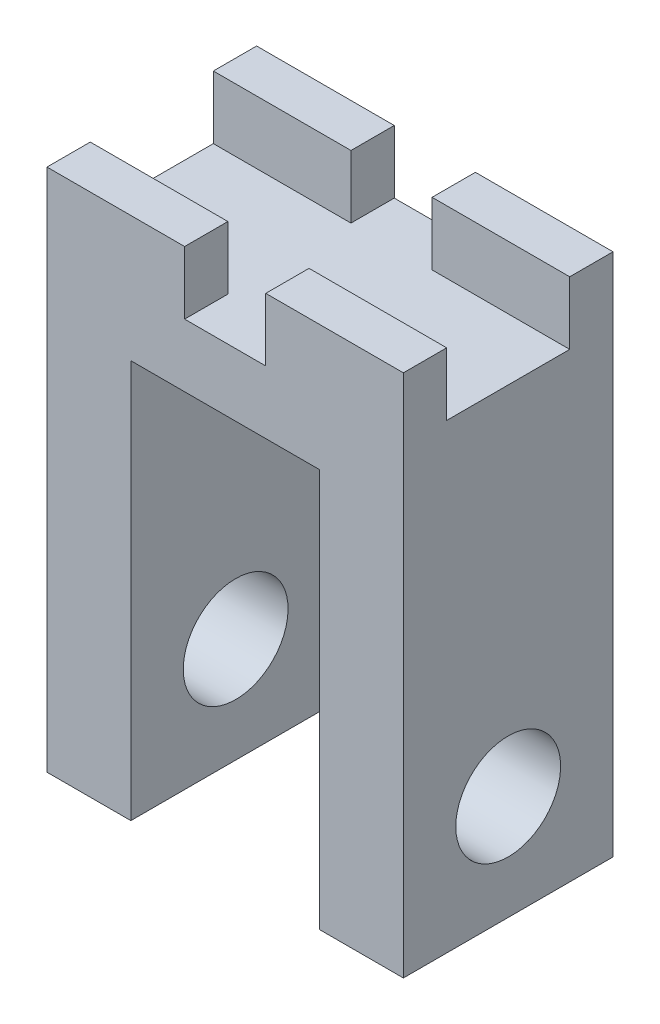
ISO-10303-21;
HEADER;
FILE_DESCRIPTION(('STEP AP214'),'2;1');
FILE_NAME('part.step','',(''),(''),'','','');
FILE_SCHEMA(('AUTOMOTIVE_DESIGN { 1 0 10303 214 1 1 1 1 }'));
ENDSEC;
DATA;
#1=APPLICATION_CONTEXT('core data for automotive mechanical design processes');
#2=APPLICATION_PROTOCOL_DEFINITION('international standard','automotive_design',2000,#1);
#3=PRODUCT_CONTEXT('',#1,'mechanical');
#4=PRODUCT('Part','Part','',(#3));
#5=PRODUCT_RELATED_PRODUCT_CATEGORY('part','',(#4));
#6=PRODUCT_DEFINITION_FORMATION('','',#4);
#7=PRODUCT_DEFINITION_CONTEXT('part definition',#1,'design');
#8=PRODUCT_DEFINITION('design','',#6,#7);
#9=PRODUCT_DEFINITION_SHAPE('','',#8);
#10=(LENGTH_UNIT() NAMED_UNIT(*) SI_UNIT(.MILLI.,.METRE.));
#11=(NAMED_UNIT(*) PLANE_ANGLE_UNIT() SI_UNIT($,.RADIAN.));
#12=(NAMED_UNIT(*) SI_UNIT($,.STERADIAN.) SOLID_ANGLE_UNIT());
#13=UNCERTAINTY_MEASURE_WITH_UNIT(LENGTH_MEASURE(1.E-05),#10,'distance_accuracy_value','');
#14=(GEOMETRIC_REPRESENTATION_CONTEXT(3) GLOBAL_UNCERTAINTY_ASSIGNED_CONTEXT((#13)) GLOBAL_UNIT_ASSIGNED_CONTEXT((#10,
#11,#12)) REPRESENTATION_CONTEXT('',''));
#15=CARTESIAN_POINT('',(0.,0.,0.));
#16=DIRECTION('',(0.,0.,1.));
#17=DIRECTION('',(1.,0.,0.));
#18=AXIS2_PLACEMENT_3D('',#15,#16,#17);
#19=CARTESIAN_POINT('',(0.,12.5,10.));
#20=DIRECTION('',(0.,1.,0.));
#21=DIRECTION('',(0.,0.,1.));
#22=AXIS2_PLACEMENT_3D('',#19,#20,#21);
#23=PLANE('',#22);
#24=DIRECTION('',(0.,0.,-1.));
#25=VECTOR('',#24,1.);
#26=CARTESIAN_POINT('',(1.935,12.5,10.));
#27=LINE('',#26,#25);
#28=CARTESIAN_POINT('',(1.935,12.5,10.));
#29=VERTEX_POINT('',#28);
#30=CARTESIAN_POINT('',(1.935,12.5,7.935));
#31=VERTEX_POINT('',#30);
#32=EDGE_CURVE('E54',#29,#31,#27,.T.);
#33=ORIENTED_EDGE('',*,*,#32,.T.);
#34=DIRECTION('',(-1.,0.,0.));
#35=VECTOR('',#34,1.);
#36=CARTESIAN_POINT('',(8.5,12.5,7.935));
#37=LINE('',#36,#35);
#38=CARTESIAN_POINT('',(8.5,12.5,7.935));
#39=VERTEX_POINT('',#38);
#40=EDGE_CURVE('E58',#39,#31,#37,.T.);
#41=ORIENTED_EDGE('',*,*,#40,.F.);
#42=DIRECTION('',(0.,0.,-1.));
#43=VECTOR('',#42,1.);
#44=CARTESIAN_POINT('',(8.5,12.5,10.));
#45=LINE('',#44,#43);
#46=CARTESIAN_POINT('',(8.5,12.5,2.065));
#47=VERTEX_POINT('',#46);
#48=EDGE_CURVE('E11',#39,#47,#45,.T.);
#49=ORIENTED_EDGE('',*,*,#48,.T.);
#50=DIRECTION('',(-1.,0.,0.));
#51=VECTOR('',#50,1.);
#52=CARTESIAN_POINT('',(8.5,12.5,2.065));
#53=LINE('',#52,#51);
#54=CARTESIAN_POINT('',(1.935,12.5,2.065));
#55=VERTEX_POINT('',#54);
#56=EDGE_CURVE('E241',#47,#55,#53,.T.);
#57=ORIENTED_EDGE('',*,*,#56,.T.);
#58=DIRECTION('',(0.,0.,1.));
#59=VECTOR('',#58,1.);
#60=CARTESIAN_POINT('',(1.935,12.5,0.));
#61=LINE('',#60,#59);
#62=CARTESIAN_POINT('',(1.935,12.5,0.));
#63=VERTEX_POINT('',#62);
#64=EDGE_CURVE('E254',#63,#55,#61,.T.);
#65=ORIENTED_EDGE('',*,*,#64,.F.);
#66=DIRECTION('',(1.,0.,0.));
#67=VECTOR('',#66,1.);
#68=CARTESIAN_POINT('',(0.,12.5,0.));
#69=LINE('',#68,#67);
#70=CARTESIAN_POINT('',(-1.935,12.5,0.));
#71=VERTEX_POINT('',#70);
#72=EDGE_CURVE('E301',#71,#63,#69,.T.);
#73=ORIENTED_EDGE('',*,*,#72,.F.);
#74=DIRECTION('',(0.,0.,1.));
#75=VECTOR('',#74,1.);
#76=CARTESIAN_POINT('',(-1.935,12.5,0.));
#77=LINE('',#76,#75);
#78=CARTESIAN_POINT('',(-1.935,12.5,2.065));
#79=VERTEX_POINT('',#78);
#80=EDGE_CURVE('E234',#71,#79,#77,.T.);
#81=ORIENTED_EDGE('',*,*,#80,.T.);
#82=DIRECTION('',(1.,0.,0.));
#83=VECTOR('',#82,1.);
#84=CARTESIAN_POINT('',(-8.5,12.5,2.065));
#85=LINE('',#84,#83);
#86=CARTESIAN_POINT('',(-8.5,12.5,2.065));
#87=VERTEX_POINT('',#86);
#88=EDGE_CURVE('E237',#87,#79,#85,.T.);
#89=ORIENTED_EDGE('',*,*,#88,.F.);
#90=DIRECTION('',(0.,0.,-1.));
#91=VECTOR('',#90,1.);
#92=CARTESIAN_POINT('',(-8.5,12.5,10.));
#93=LINE('',#92,#91);
#94=CARTESIAN_POINT('',(-8.5,12.5,7.935));
#95=VERTEX_POINT('',#94);
#96=EDGE_CURVE('E47',#95,#87,#93,.T.);
#97=ORIENTED_EDGE('',*,*,#96,.F.);
#98=DIRECTION('',(1.,0.,0.));
#99=VECTOR('',#98,1.);
#100=CARTESIAN_POINT('',(-8.5,12.5,7.935));
#101=LINE('',#100,#99);
#102=CARTESIAN_POINT('',(-1.935,12.5,7.935));
#103=VERTEX_POINT('',#102);
#104=EDGE_CURVE('E214',#95,#103,#101,.T.);
#105=ORIENTED_EDGE('',*,*,#104,.T.);
#106=DIRECTION('',(0.,0.,-1.));
#107=VECTOR('',#106,1.);
#108=CARTESIAN_POINT('',(-1.935,12.5,10.));
#109=LINE('',#108,#107);
#110=CARTESIAN_POINT('',(-1.935,12.5,10.));
#111=VERTEX_POINT('',#110);
#112=EDGE_CURVE('E211',#111,#103,#109,.T.);
#113=ORIENTED_EDGE('',*,*,#112,.F.);
#114=DIRECTION('',(1.,0.,0.));
#115=VECTOR('',#114,1.);
#116=CARTESIAN_POINT('',(0.,12.5,10.));
#117=LINE('',#116,#115);
#118=EDGE_CURVE('E284',#111,#29,#117,.T.);
#119=ORIENTED_EDGE('',*,*,#118,.T.);
#120=EDGE_LOOP('',(#33,#41,#49,#57,#65,#73,#81,#89,#97,#105,#113,#119));
#121=FACE_BOUND('',#120,.T.);
#122=ADVANCED_FACE('F38',(#121),#23,.T.);
#123=CARTESIAN_POINT('',(8.5,0.,10.));
#124=DIRECTION('',(1.,0.,0.));
#125=DIRECTION('',(0.,1.,0.));
#126=AXIS2_PLACEMENT_3D('',#123,#124,#125);
#127=PLANE('',#126);
#128=CARTESIAN_POINT('',(8.5,-4.5,5.));
#129=DIRECTION('',(-1.,0.,0.));
#130=DIRECTION('',(0.,0.,1.));
#131=AXIS2_PLACEMENT_3D('',#128,#129,#130);
#132=CIRCLE('',#131,2.5);
#133=CARTESIAN_POINT('',(8.5,-4.5,7.5));
#134=VERTEX_POINT('',#133);
#135=EDGE_CURVE('E267',#134,#134,#132,.T.);
#136=ORIENTED_EDGE('',*,*,#135,.T.);
#137=EDGE_LOOP('',(#136));
#138=FACE_BOUND('',#137,.T.);
#139=DIRECTION('',(0.,-1.,0.));
#140=VECTOR('',#139,1.);
#141=CARTESIAN_POINT('',(8.5,0.,0.));
#142=LINE('',#141,#140);
#143=CARTESIAN_POINT('',(8.5,15.5,0.));
#144=VERTEX_POINT('',#143);
#145=CARTESIAN_POINT('',(8.5,-9.5,0.));
#146=VERTEX_POINT('',#145);
#147=EDGE_CURVE('E281',#144,#146,#142,.T.);
#148=ORIENTED_EDGE('',*,*,#147,.F.);
#149=DIRECTION('',(0.,0.,1.));
#150=VECTOR('',#149,1.);
#151=CARTESIAN_POINT('',(8.5,15.5,0.));
#152=LINE('',#151,#150);
#153=CARTESIAN_POINT('',(8.5,15.5,2.065));
#154=VERTEX_POINT('',#153);
#155=EDGE_CURVE('E258',#144,#154,#152,.T.);
#156=ORIENTED_EDGE('',*,*,#155,.T.);
#157=DIRECTION('',(0.,-1.,0.));
#158=VECTOR('',#157,1.);
#159=CARTESIAN_POINT('',(8.5,15.5,2.065));
#160=LINE('',#159,#158);
#161=EDGE_CURVE('E265',#154,#47,#160,.T.);
#162=ORIENTED_EDGE('',*,*,#161,.T.);
#163=ORIENTED_EDGE('',*,*,#48,.F.);
#164=DIRECTION('',(0.,-1.,0.));
#165=VECTOR('',#164,1.);
#166=CARTESIAN_POINT('',(8.5,15.5,7.935));
#167=LINE('',#166,#165);
#168=CARTESIAN_POINT('',(8.5,15.5,7.935));
#169=VERTEX_POINT('',#168);
#170=EDGE_CURVE('E185',#169,#39,#167,.T.);
#171=ORIENTED_EDGE('',*,*,#170,.F.);
#172=DIRECTION('',(0.,0.,-1.));
#173=VECTOR('',#172,1.);
#174=CARTESIAN_POINT('',(8.5,15.5,10.));
#175=LINE('',#174,#173);
#176=CARTESIAN_POINT('',(8.5,15.5,10.));
#177=VERTEX_POINT('',#176);
#178=EDGE_CURVE('E174',#177,#169,#175,.T.);
#179=ORIENTED_EDGE('',*,*,#178,.F.);
#180=DIRECTION('',(0.,-1.,0.));
#181=VECTOR('',#180,1.);
#182=CARTESIAN_POINT('',(8.5,0.,10.));
#183=LINE('',#182,#181);
#184=CARTESIAN_POINT('',(8.5,-9.5,10.));
#185=VERTEX_POINT('',#184);
#186=EDGE_CURVE('E282',#177,#185,#183,.T.);
#187=ORIENTED_EDGE('',*,*,#186,.T.);
#188=DIRECTION('',(0.,0.,-1.));
#189=VECTOR('',#188,1.);
#190=CARTESIAN_POINT('',(8.5,-9.5,10.));
#191=LINE('',#190,#189);
#192=EDGE_CURVE('E315',#185,#146,#191,.T.);
#193=ORIENTED_EDGE('',*,*,#192,.T.);
#194=EDGE_LOOP('',(#148,#156,#162,#163,#171,#179,#187,#193));
#195=FACE_BOUND('',#194,.T.);
#196=ADVANCED_FACE('F40',(#138,#195),#127,.T.);
#197=CARTESIAN_POINT('',(-8.5,0.,10.));
#198=DIRECTION('',(1.,0.,0.));
#199=DIRECTION('',(0.,1.,0.));
#200=AXIS2_PLACEMENT_3D('',#197,#198,#199);
#201=PLANE('',#200);
#202=CARTESIAN_POINT('',(-8.5,-4.5,5.));
#203=DIRECTION('',(1.,0.,0.));
#204=DIRECTION('',(0.,1.,0.));
#205=AXIS2_PLACEMENT_3D('',#202,#203,#204);
#206=CIRCLE('',#205,2.5);
#207=CARTESIAN_POINT('',(-8.5,-2.,5.));
#208=VERTEX_POINT('',#207);
#209=EDGE_CURVE('E278',#208,#208,#206,.T.);
#210=ORIENTED_EDGE('',*,*,#209,.T.);
#211=EDGE_LOOP('',(#210));
#212=FACE_BOUND('',#211,.T.);
#213=DIRECTION('',(0.,-1.,0.));
#214=VECTOR('',#213,1.);
#215=CARTESIAN_POINT('',(-8.5,0.,0.));
#216=LINE('',#215,#214);
#217=CARTESIAN_POINT('',(-8.5,15.5,0.));
#218=VERTEX_POINT('',#217);
#219=CARTESIAN_POINT('',(-8.5,-9.5,0.));
#220=VERTEX_POINT('',#219);
#221=EDGE_CURVE('E303',#218,#220,#216,.T.);
#222=ORIENTED_EDGE('',*,*,#221,.T.);
#223=DIRECTION('',(0.,0.,-1.));
#224=VECTOR('',#223,1.);
#225=CARTESIAN_POINT('',(-8.5,-9.5,10.));
#226=LINE('',#225,#224);
#227=CARTESIAN_POINT('',(-8.5,-9.5,10.));
#228=VERTEX_POINT('',#227);
#229=EDGE_CURVE('E327',#228,#220,#226,.T.);
#230=ORIENTED_EDGE('',*,*,#229,.F.);
#231=DIRECTION('',(0.,-1.,0.));
#232=VECTOR('',#231,1.);
#233=CARTESIAN_POINT('',(-8.5,0.,10.));
#234=LINE('',#233,#232);
#235=CARTESIAN_POINT('',(-8.5,15.5,10.));
#236=VERTEX_POINT('',#235);
#237=EDGE_CURVE('E287',#236,#228,#234,.T.);
#238=ORIENTED_EDGE('',*,*,#237,.F.);
#239=DIRECTION('',(0.,0.,-1.));
#240=VECTOR('',#239,1.);
#241=CARTESIAN_POINT('',(-8.5,15.5,10.));
#242=LINE('',#241,#240);
#243=CARTESIAN_POINT('',(-8.5,15.5,7.935));
#244=VERTEX_POINT('',#243);
#245=EDGE_CURVE('E204',#236,#244,#242,.T.);
#246=ORIENTED_EDGE('',*,*,#245,.T.);
#247=DIRECTION('',(0.,-1.,0.));
#248=VECTOR('',#247,1.);
#249=CARTESIAN_POINT('',(-8.5,15.5,7.935));
#250=LINE('',#249,#248);
#251=EDGE_CURVE('E208',#244,#95,#250,.T.);
#252=ORIENTED_EDGE('',*,*,#251,.T.);
#253=ORIENTED_EDGE('',*,*,#96,.T.);
#254=DIRECTION('',(0.,-1.,0.));
#255=VECTOR('',#254,1.);
#256=CARTESIAN_POINT('',(-8.5,15.5,2.065));
#257=LINE('',#256,#255);
#258=CARTESIAN_POINT('',(-8.5,15.5,2.065));
#259=VERTEX_POINT('',#258);
#260=EDGE_CURVE('E230',#259,#87,#257,.T.);
#261=ORIENTED_EDGE('',*,*,#260,.F.);
#262=DIRECTION('',(0.,0.,1.));
#263=VECTOR('',#262,1.);
#264=CARTESIAN_POINT('',(-8.5,15.5,0.));
#265=LINE('',#264,#263);
#266=EDGE_CURVE('E233',#218,#259,#265,.T.);
#267=ORIENTED_EDGE('',*,*,#266,.F.);
#268=EDGE_LOOP('',(#222,#230,#238,#246,#252,#253,#261,#267));
#269=FACE_BOUND('',#268,.T.);
#270=ADVANCED_FACE('F332',(#212,#269),#201,.F.);
#271=CARTESIAN_POINT('',(0.,-9.5,10.));
#272=DIRECTION('',(0.,1.,0.));
#273=DIRECTION('',(0.,0.,1.));
#274=AXIS2_PLACEMENT_3D('',#271,#272,#273);
#275=PLANE('',#274);
#276=DIRECTION('',(1.,0.,0.));
#277=VECTOR('',#276,1.);
#278=CARTESIAN_POINT('',(0.,-9.5,0.));
#279=LINE('',#278,#277);
#280=CARTESIAN_POINT('',(-4.5,-9.5,0.));
#281=VERTEX_POINT('',#280);
#282=EDGE_CURVE('E305',#220,#281,#279,.T.);
#283=ORIENTED_EDGE('',*,*,#282,.T.);
#284=DIRECTION('',(0.,0.,-1.));
#285=VECTOR('',#284,1.);
#286=CARTESIAN_POINT('',(-4.5,-9.5,10.));
#287=LINE('',#286,#285);
#288=CARTESIAN_POINT('',(-4.5,-9.5,10.));
#289=VERTEX_POINT('',#288);
#290=EDGE_CURVE('E325',#289,#281,#287,.T.);
#291=ORIENTED_EDGE('',*,*,#290,.F.);
#292=DIRECTION('',(1.,0.,0.));
#293=VECTOR('',#292,1.);
#294=CARTESIAN_POINT('',(0.,-9.5,10.));
#295=LINE('',#294,#293);
#296=EDGE_CURVE('E289',#228,#289,#295,.T.);
#297=ORIENTED_EDGE('',*,*,#296,.F.);
#298=ORIENTED_EDGE('',*,*,#229,.T.);
#299=EDGE_LOOP('',(#283,#291,#297,#298));
#300=FACE_BOUND('',#299,.T.);
#301=ADVANCED_FACE('F355',(#300),#275,.F.);
#302=CARTESIAN_POINT('',(-4.5,0.,10.));
#303=DIRECTION('',(1.,0.,0.));
#304=DIRECTION('',(0.,1.,0.));
#305=AXIS2_PLACEMENT_3D('',#302,#303,#304);
#306=PLANE('',#305);
#307=CARTESIAN_POINT('',(-4.5,-4.5,5.));
#308=DIRECTION('',(1.,0.,0.));
#309=DIRECTION('',(0.,1.,0.));
#310=AXIS2_PLACEMENT_3D('',#307,#308,#309);
#311=CIRCLE('',#310,2.5);
#312=CARTESIAN_POINT('',(-4.5,-2.,5.));
#313=VERTEX_POINT('',#312);
#314=EDGE_CURVE('E275',#313,#313,#311,.T.);
#315=ORIENTED_EDGE('',*,*,#314,.F.);
#316=EDGE_LOOP('',(#315));
#317=FACE_BOUND('',#316,.T.);
#318=DIRECTION('',(0.,-1.,0.));
#319=VECTOR('',#318,1.);
#320=CARTESIAN_POINT('',(-4.5,0.,0.));
#321=LINE('',#320,#319);
#322=CARTESIAN_POINT('',(-4.5,9.5,0.));
#323=VERTEX_POINT('',#322);
#324=EDGE_CURVE('E308',#323,#281,#321,.T.);
#325=ORIENTED_EDGE('',*,*,#324,.F.);
#326=DIRECTION('',(0.,0.,-1.));
#327=VECTOR('',#326,1.);
#328=CARTESIAN_POINT('',(-4.5,9.5,10.));
#329=LINE('',#328,#327);
#330=CARTESIAN_POINT('',(-4.5,9.5,10.));
#331=VERTEX_POINT('',#330);
#332=EDGE_CURVE('E323',#331,#323,#329,.T.);
#333=ORIENTED_EDGE('',*,*,#332,.F.);
#334=DIRECTION('',(0.,-1.,0.));
#335=VECTOR('',#334,1.);
#336=CARTESIAN_POINT('',(-4.5,0.,10.));
#337=LINE('',#336,#335);
#338=EDGE_CURVE('E291',#331,#289,#337,.T.);
#339=ORIENTED_EDGE('',*,*,#338,.T.);
#340=ORIENTED_EDGE('',*,*,#290,.T.);
#341=EDGE_LOOP('',(#325,#333,#339,#340));
#342=FACE_BOUND('',#341,.T.);
#343=ADVANCED_FACE('F361',(#317,#342),#306,.T.);
#344=CARTESIAN_POINT('',(0.,9.5,10.));
#345=DIRECTION('',(0.,1.,0.));
#346=DIRECTION('',(0.,0.,1.));
#347=AXIS2_PLACEMENT_3D('',#344,#345,#346);
#348=PLANE('',#347);
#349=DIRECTION('',(1.,0.,0.));
#350=VECTOR('',#349,1.);
#351=CARTESIAN_POINT('',(0.,9.5,0.));
#352=LINE('',#351,#350);
#353=CARTESIAN_POINT('',(4.5,9.5,0.));
#354=VERTEX_POINT('',#353);
#355=EDGE_CURVE('E311',#323,#354,#352,.T.);
#356=ORIENTED_EDGE('',*,*,#355,.T.);
#357=DIRECTION('',(0.,0.,-1.));
#358=VECTOR('',#357,1.);
#359=CARTESIAN_POINT('',(4.5,9.5,10.));
#360=LINE('',#359,#358);
#361=CARTESIAN_POINT('',(4.5,9.5,10.));
#362=VERTEX_POINT('',#361);
#363=EDGE_CURVE('E320',#362,#354,#360,.T.);
#364=ORIENTED_EDGE('',*,*,#363,.F.);
#365=DIRECTION('',(1.,0.,0.));
#366=VECTOR('',#365,1.);
#367=CARTESIAN_POINT('',(0.,9.5,10.));
#368=LINE('',#367,#366);
#369=EDGE_CURVE('E295',#331,#362,#368,.T.);
#370=ORIENTED_EDGE('',*,*,#369,.F.);
#371=ORIENTED_EDGE('',*,*,#332,.T.);
#372=EDGE_LOOP('',(#356,#364,#370,#371));
#373=FACE_BOUND('',#372,.T.);
#374=ADVANCED_FACE('F405',(#373),#348,.F.);
#375=CARTESIAN_POINT('',(4.5,0.,10.));
#376=DIRECTION('',(1.,0.,0.));
#377=DIRECTION('',(0.,1.,0.));
#378=AXIS2_PLACEMENT_3D('',#375,#376,#377);
#379=PLANE('',#378);
#380=CARTESIAN_POINT('',(4.5,-4.5,5.));
#381=DIRECTION('',(1.,0.,0.));
#382=DIRECTION('',(0.,1.,0.));
#383=AXIS2_PLACEMENT_3D('',#380,#381,#382);
#384=CIRCLE('',#383,2.5);
#385=CARTESIAN_POINT('',(4.5,-2.,5.));
#386=VERTEX_POINT('',#385);
#387=EDGE_CURVE('E42',#386,#386,#384,.T.);
#388=ORIENTED_EDGE('',*,*,#387,.T.);
#389=EDGE_LOOP('',(#388));
#390=FACE_BOUND('',#389,.T.);
#391=DIRECTION('',(0.,-1.,0.));
#392=VECTOR('',#391,1.);
#393=CARTESIAN_POINT('',(4.5,0.,0.));
#394=LINE('',#393,#392);
#395=CARTESIAN_POINT('',(4.5,-9.5,0.));
#396=VERTEX_POINT('',#395);
#397=EDGE_CURVE('E313',#354,#396,#394,.T.);
#398=ORIENTED_EDGE('',*,*,#397,.T.);
#399=DIRECTION('',(0.,0.,-1.));
#400=VECTOR('',#399,1.);
#401=CARTESIAN_POINT('',(4.5,-9.5,10.));
#402=LINE('',#401,#400);
#403=CARTESIAN_POINT('',(4.5,-9.5,10.));
#404=VERTEX_POINT('',#403);
#405=EDGE_CURVE('E317',#404,#396,#402,.T.);
#406=ORIENTED_EDGE('',*,*,#405,.F.);
#407=DIRECTION('',(0.,-1.,0.));
#408=VECTOR('',#407,1.);
#409=CARTESIAN_POINT('',(4.5,0.,10.));
#410=LINE('',#409,#408);
#411=EDGE_CURVE('E297',#362,#404,#410,.T.);
#412=ORIENTED_EDGE('',*,*,#411,.F.);
#413=ORIENTED_EDGE('',*,*,#363,.T.);
#414=EDGE_LOOP('',(#398,#406,#412,#413));
#415=FACE_BOUND('',#414,.T.);
#416=ADVANCED_FACE('F409',(#390,#415),#379,.F.);
#417=EDGE_CURVE('E285',#396,#146,#279,.T.);
#418=ORIENTED_EDGE('',*,*,#417,.T.);
#419=ORIENTED_EDGE('',*,*,#192,.F.);
#420=EDGE_CURVE('E292',#404,#185,#295,.T.);
#421=ORIENTED_EDGE('',*,*,#420,.F.);
#422=ORIENTED_EDGE('',*,*,#405,.T.);
#423=EDGE_LOOP('',(#418,#419,#421,#422));
#424=FACE_BOUND('',#423,.T.);
#425=ADVANCED_FACE('F413',(#424),#275,.F.);
#426=CARTESIAN_POINT('',(0.,0.,10.));
#427=DIRECTION('',(0.,0.,1.));
#428=DIRECTION('',(1.,0.,0.));
#429=AXIS2_PLACEMENT_3D('',#426,#427,#428);
#430=PLANE('',#429);
#431=ORIENTED_EDGE('',*,*,#186,.F.);
#432=DIRECTION('',(-1.,0.,0.));
#433=VECTOR('',#432,1.);
#434=CARTESIAN_POINT('',(8.5,15.5,10.));
#435=LINE('',#434,#433);
#436=CARTESIAN_POINT('',(1.935,15.5,10.));
#437=VERTEX_POINT('',#436);
#438=EDGE_CURVE('E182',#177,#437,#435,.T.);
#439=ORIENTED_EDGE('',*,*,#438,.T.);
#440=DIRECTION('',(0.,-1.,0.));
#441=VECTOR('',#440,1.);
#442=CARTESIAN_POINT('',(1.935,15.5,10.));
#443=LINE('',#442,#441);
#444=EDGE_CURVE('E190',#437,#29,#443,.T.);
#445=ORIENTED_EDGE('',*,*,#444,.T.);
#446=ORIENTED_EDGE('',*,*,#118,.F.);
#447=DIRECTION('',(0.,-1.,0.));
#448=VECTOR('',#447,1.);
#449=CARTESIAN_POINT('',(-1.935,15.5,10.));
#450=LINE('',#449,#448);
#451=CARTESIAN_POINT('',(-1.935,15.5,10.));
#452=VERTEX_POINT('',#451);
#453=EDGE_CURVE('E205',#452,#111,#450,.T.);
#454=ORIENTED_EDGE('',*,*,#453,.F.);
#455=DIRECTION('',(1.,0.,0.));
#456=VECTOR('',#455,1.);
#457=CARTESIAN_POINT('',(-8.5,15.5,10.));
#458=LINE('',#457,#456);
#459=EDGE_CURVE('E220',#236,#452,#458,.T.);
#460=ORIENTED_EDGE('',*,*,#459,.F.);
#461=ORIENTED_EDGE('',*,*,#237,.T.);
#462=ORIENTED_EDGE('',*,*,#296,.T.);
#463=ORIENTED_EDGE('',*,*,#338,.F.);
#464=ORIENTED_EDGE('',*,*,#369,.T.);
#465=ORIENTED_EDGE('',*,*,#411,.T.);
#466=ORIENTED_EDGE('',*,*,#420,.T.);
#467=EDGE_LOOP('',(#431,#439,#445,#446,#454,#460,#461,#462,#463,#464,#465,#466));
#468=FACE_BOUND('',#467,.T.);
#469=ADVANCED_FACE('F365',(#468),#430,.T.);
#470=CARTESIAN_POINT('',(0.,0.,0.));
#471=DIRECTION('',(0.,0.,1.));
#472=DIRECTION('',(1.,0.,0.));
#473=AXIS2_PLACEMENT_3D('',#470,#471,#472);
#474=PLANE('',#473);
#475=ORIENTED_EDGE('',*,*,#147,.T.);
#476=ORIENTED_EDGE('',*,*,#417,.F.);
#477=ORIENTED_EDGE('',*,*,#397,.F.);
#478=ORIENTED_EDGE('',*,*,#355,.F.);
#479=ORIENTED_EDGE('',*,*,#324,.T.);
#480=ORIENTED_EDGE('',*,*,#282,.F.);
#481=ORIENTED_EDGE('',*,*,#221,.F.);
#482=DIRECTION('',(1.,0.,0.));
#483=VECTOR('',#482,1.);
#484=CARTESIAN_POINT('',(-8.5,15.5,0.));
#485=LINE('',#484,#483);
#486=CARTESIAN_POINT('',(-1.935,15.5,0.));
#487=VERTEX_POINT('',#486);
#488=EDGE_CURVE('E243',#218,#487,#485,.T.);
#489=ORIENTED_EDGE('',*,*,#488,.T.);
#490=DIRECTION('',(0.,-1.,0.));
#491=VECTOR('',#490,1.);
#492=CARTESIAN_POINT('',(-1.935,15.5,0.));
#493=LINE('',#492,#491);
#494=EDGE_CURVE('E227',#487,#71,#493,.T.);
#495=ORIENTED_EDGE('',*,*,#494,.T.);
#496=ORIENTED_EDGE('',*,*,#72,.T.);
#497=DIRECTION('',(0.,-1.,0.));
#498=VECTOR('',#497,1.);
#499=CARTESIAN_POINT('',(1.935,15.5,0.));
#500=LINE('',#499,#498);
#501=CARTESIAN_POINT('',(1.935,15.5,0.));
#502=VERTEX_POINT('',#501);
#503=EDGE_CURVE('E268',#502,#63,#500,.T.);
#504=ORIENTED_EDGE('',*,*,#503,.F.);
#505=DIRECTION('',(-1.,0.,0.));
#506=VECTOR('',#505,1.);
#507=CARTESIAN_POINT('',(8.5,15.5,0.));
#508=LINE('',#507,#506);
#509=EDGE_CURVE('E256',#144,#502,#508,.T.);
#510=ORIENTED_EDGE('',*,*,#509,.F.);
#511=EDGE_LOOP('',(#475,#476,#477,#478,#479,#480,#481,#489,#495,#496,#504,#510));
#512=FACE_BOUND('',#511,.T.);
#513=ADVANCED_FACE('F346',(#512),#474,.F.);
#514=CARTESIAN_POINT('',(8.5,-4.5,5.));
#515=DIRECTION('',(-1.,0.,0.));
#516=DIRECTION('',(0.,0.,1.));
#517=AXIS2_PLACEMENT_3D('',#514,#515,#516);
#518=CYLINDRICAL_SURFACE('',#517,2.5);
#519=ORIENTED_EDGE('',*,*,#135,.F.);
#520=EDGE_LOOP('',(#519));
#521=FACE_BOUND('',#520,.T.);
#522=ORIENTED_EDGE('',*,*,#387,.F.);
#523=EDGE_LOOP('',(#522));
#524=FACE_BOUND('',#523,.T.);
#525=ADVANCED_FACE('F420',(#521,#524),#518,.F.);
#526=ORIENTED_EDGE('',*,*,#314,.T.);
#527=EDGE_LOOP('',(#526));
#528=FACE_BOUND('',#527,.T.);
#529=ORIENTED_EDGE('',*,*,#209,.F.);
#530=EDGE_LOOP('',(#529));
#531=FACE_BOUND('',#530,.T.);
#532=ADVANCED_FACE('F423',(#528,#531),#518,.F.);
#533=CARTESIAN_POINT('',(8.5,15.5,2.065));
#534=DIRECTION('',(0.,0.,1.));
#535=DIRECTION('',(1.,0.,0.));
#536=AXIS2_PLACEMENT_3D('',#533,#534,#535);
#537=PLANE('',#536);
#538=ORIENTED_EDGE('',*,*,#56,.F.);
#539=ORIENTED_EDGE('',*,*,#161,.F.);
#540=DIRECTION('',(-1.,0.,0.));
#541=VECTOR('',#540,1.);
#542=CARTESIAN_POINT('',(8.5,15.5,2.065));
#543=LINE('',#542,#541);
#544=CARTESIAN_POINT('',(1.935,15.5,2.065));
#545=VERTEX_POINT('',#544);
#546=EDGE_CURVE('E250',#154,#545,#543,.T.);
#547=ORIENTED_EDGE('',*,*,#546,.T.);
#548=DIRECTION('',(0.,-1.,0.));
#549=VECTOR('',#548,1.);
#550=CARTESIAN_POINT('',(1.935,15.5,2.065));
#551=LINE('',#550,#549);
#552=EDGE_CURVE('E261',#545,#55,#551,.T.);
#553=ORIENTED_EDGE('',*,*,#552,.T.);
#554=EDGE_LOOP('',(#538,#539,#547,#553));
#555=FACE_BOUND('',#554,.T.);
#556=ADVANCED_FACE('F426',(#555),#537,.T.);
#557=CARTESIAN_POINT('',(1.935,15.5,0.));
#558=DIRECTION('',(1.,0.,0.));
#559=DIRECTION('',(0.,0.,-1.));
#560=AXIS2_PLACEMENT_3D('',#557,#558,#559);
#561=PLANE('',#560);
#562=ORIENTED_EDGE('',*,*,#64,.T.);
#563=ORIENTED_EDGE('',*,*,#552,.F.);
#564=DIRECTION('',(0.,0.,1.));
#565=VECTOR('',#564,1.);
#566=CARTESIAN_POINT('',(1.935,15.5,0.));
#567=LINE('',#566,#565);
#568=EDGE_CURVE('E253',#502,#545,#567,.T.);
#569=ORIENTED_EDGE('',*,*,#568,.F.);
#570=ORIENTED_EDGE('',*,*,#503,.T.);
#571=EDGE_LOOP('',(#562,#563,#569,#570));
#572=FACE_BOUND('',#571,.T.);
#573=ADVANCED_FACE('F430',(#572),#561,.F.);
#574=CARTESIAN_POINT('',(0.,15.5,0.));
#575=DIRECTION('',(0.,1.,0.));
#576=DIRECTION('',(0.,0.,1.));
#577=AXIS2_PLACEMENT_3D('',#574,#575,#576);
#578=PLANE('',#577);
#579=ORIENTED_EDGE('',*,*,#546,.F.);
#580=ORIENTED_EDGE('',*,*,#155,.F.);
#581=ORIENTED_EDGE('',*,*,#509,.T.);
#582=ORIENTED_EDGE('',*,*,#568,.T.);
#583=EDGE_LOOP('',(#579,#580,#581,#582));
#584=FACE_BOUND('',#583,.T.);
#585=ADVANCED_FACE('F434',(#584),#578,.T.);
#586=CARTESIAN_POINT('',(-8.5,15.5,2.065));
#587=DIRECTION('',(0.,0.,-1.));
#588=DIRECTION('',(-1.,0.,0.));
#589=AXIS2_PLACEMENT_3D('',#586,#587,#588);
#590=PLANE('',#589);
#591=ORIENTED_EDGE('',*,*,#88,.T.);
#592=DIRECTION('',(0.,-1.,0.));
#593=VECTOR('',#592,1.);
#594=CARTESIAN_POINT('',(-1.935,15.5,2.065));
#595=LINE('',#594,#593);
#596=CARTESIAN_POINT('',(-1.935,15.5,2.065));
#597=VERTEX_POINT('',#596);
#598=EDGE_CURVE('E217',#597,#79,#595,.T.);
#599=ORIENTED_EDGE('',*,*,#598,.F.);
#600=DIRECTION('',(1.,0.,0.));
#601=VECTOR('',#600,1.);
#602=CARTESIAN_POINT('',(-8.5,15.5,2.065));
#603=LINE('',#602,#601);
#604=EDGE_CURVE('E238',#259,#597,#603,.T.);
#605=ORIENTED_EDGE('',*,*,#604,.F.);
#606=ORIENTED_EDGE('',*,*,#260,.T.);
#607=EDGE_LOOP('',(#591,#599,#605,#606));
#608=FACE_BOUND('',#607,.T.);
#609=ADVANCED_FACE('F338',(#608),#590,.F.);
#610=CARTESIAN_POINT('',(-1.935,15.5,0.));
#611=DIRECTION('',(1.,0.,0.));
#612=DIRECTION('',(0.,0.,-1.));
#613=AXIS2_PLACEMENT_3D('',#610,#611,#612);
#614=PLANE('',#613);
#615=ORIENTED_EDGE('',*,*,#80,.F.);
#616=ORIENTED_EDGE('',*,*,#494,.F.);
#617=DIRECTION('',(0.,0.,1.));
#618=VECTOR('',#617,1.);
#619=CARTESIAN_POINT('',(-1.935,15.5,0.));
#620=LINE('',#619,#618);
#621=EDGE_CURVE('E246',#487,#597,#620,.T.);
#622=ORIENTED_EDGE('',*,*,#621,.T.);
#623=ORIENTED_EDGE('',*,*,#598,.T.);
#624=EDGE_LOOP('',(#615,#616,#622,#623));
#625=FACE_BOUND('',#624,.T.);
#626=ADVANCED_FACE('F343',(#625),#614,.T.);
#627=CARTESIAN_POINT('',(0.,15.5,0.));
#628=DIRECTION('',(0.,-1.,0.));
#629=DIRECTION('',(0.,0.,-1.));
#630=AXIS2_PLACEMENT_3D('',#627,#628,#629);
#631=PLANE('',#630);
#632=ORIENTED_EDGE('',*,*,#604,.T.);
#633=ORIENTED_EDGE('',*,*,#621,.F.);
#634=ORIENTED_EDGE('',*,*,#488,.F.);
#635=ORIENTED_EDGE('',*,*,#266,.T.);
#636=EDGE_LOOP('',(#632,#633,#634,#635));
#637=FACE_BOUND('',#636,.T.);
#638=ADVANCED_FACE('F351',(#637),#631,.F.);
#639=CARTESIAN_POINT('',(-8.5,15.5,7.935));
#640=DIRECTION('',(0.,0.,-1.));
#641=DIRECTION('',(-1.,0.,0.));
#642=AXIS2_PLACEMENT_3D('',#639,#640,#641);
#643=PLANE('',#642);
#644=ORIENTED_EDGE('',*,*,#104,.F.);
#645=ORIENTED_EDGE('',*,*,#251,.F.);
#646=DIRECTION('',(1.,0.,0.));
#647=VECTOR('',#646,1.);
#648=CARTESIAN_POINT('',(-8.5,15.5,7.935));
#649=LINE('',#648,#647);
#650=CARTESIAN_POINT('',(-1.935,15.5,7.935));
#651=VERTEX_POINT('',#650);
#652=EDGE_CURVE('E215',#244,#651,#649,.T.);
#653=ORIENTED_EDGE('',*,*,#652,.T.);
#654=DIRECTION('',(0.,-1.,0.));
#655=VECTOR('',#654,1.);
#656=CARTESIAN_POINT('',(-1.935,15.5,7.935));
#657=LINE('',#656,#655);
#658=EDGE_CURVE('E201',#651,#103,#657,.T.);
#659=ORIENTED_EDGE('',*,*,#658,.T.);
#660=EDGE_LOOP('',(#644,#645,#653,#659));
#661=FACE_BOUND('',#660,.T.);
#662=ADVANCED_FACE('F376',(#661),#643,.T.);
#663=CARTESIAN_POINT('',(-1.935,15.5,10.));
#664=DIRECTION('',(-1.,0.,0.));
#665=DIRECTION('',(0.,0.,1.));
#666=AXIS2_PLACEMENT_3D('',#663,#664,#665);
#667=PLANE('',#666);
#668=ORIENTED_EDGE('',*,*,#112,.T.);
#669=ORIENTED_EDGE('',*,*,#658,.F.);
#670=DIRECTION('',(0.,0.,-1.));
#671=VECTOR('',#670,1.);
#672=CARTESIAN_POINT('',(-1.935,15.5,10.));
#673=LINE('',#672,#671);
#674=EDGE_CURVE('E222',#452,#651,#673,.T.);
#675=ORIENTED_EDGE('',*,*,#674,.F.);
#676=ORIENTED_EDGE('',*,*,#453,.T.);
#677=EDGE_LOOP('',(#668,#669,#675,#676));
#678=FACE_BOUND('',#677,.T.);
#679=ADVANCED_FACE('F380',(#678),#667,.F.);
#680=CARTESIAN_POINT('',(0.,15.5,0.));
#681=DIRECTION('',(0.,1.,0.));
#682=DIRECTION('',(0.,0.,1.));
#683=AXIS2_PLACEMENT_3D('',#680,#681,#682);
#684=PLANE('',#683);
#685=ORIENTED_EDGE('',*,*,#652,.F.);
#686=ORIENTED_EDGE('',*,*,#245,.F.);
#687=ORIENTED_EDGE('',*,*,#459,.T.);
#688=ORIENTED_EDGE('',*,*,#674,.T.);
#689=EDGE_LOOP('',(#685,#686,#687,#688));
#690=FACE_BOUND('',#689,.T.);
#691=ADVANCED_FACE('F372',(#690),#684,.T.);
#692=CARTESIAN_POINT('',(8.5,15.5,7.935));
#693=DIRECTION('',(0.,0.,1.));
#694=DIRECTION('',(1.,0.,0.));
#695=AXIS2_PLACEMENT_3D('',#692,#693,#694);
#696=PLANE('',#695);
#697=ORIENTED_EDGE('',*,*,#40,.T.);
#698=DIRECTION('',(0.,-1.,0.));
#699=VECTOR('',#698,1.);
#700=CARTESIAN_POINT('',(1.935,15.5,7.935));
#701=LINE('',#700,#699);
#702=CARTESIAN_POINT('',(1.935,15.5,7.935));
#703=VERTEX_POINT('',#702);
#704=EDGE_CURVE('E193',#703,#31,#701,.T.);
#705=ORIENTED_EDGE('',*,*,#704,.F.);
#706=DIRECTION('',(-1.,0.,0.));
#707=VECTOR('',#706,1.);
#708=CARTESIAN_POINT('',(8.5,15.5,7.935));
#709=LINE('',#708,#707);
#710=EDGE_CURVE('E179',#169,#703,#709,.T.);
#711=ORIENTED_EDGE('',*,*,#710,.F.);
#712=ORIENTED_EDGE('',*,*,#170,.T.);
#713=EDGE_LOOP('',(#697,#705,#711,#712));
#714=FACE_BOUND('',#713,.T.);
#715=ADVANCED_FACE('F192',(#714),#696,.F.);
#716=CARTESIAN_POINT('',(1.935,15.5,10.));
#717=DIRECTION('',(-1.,0.,0.));
#718=DIRECTION('',(0.,0.,1.));
#719=AXIS2_PLACEMENT_3D('',#716,#717,#718);
#720=PLANE('',#719);
#721=ORIENTED_EDGE('',*,*,#32,.F.);
#722=ORIENTED_EDGE('',*,*,#444,.F.);
#723=DIRECTION('',(0.,0.,-1.));
#724=VECTOR('',#723,1.);
#725=CARTESIAN_POINT('',(1.935,15.5,10.));
#726=LINE('',#725,#724);
#727=EDGE_CURVE('E195',#437,#703,#726,.T.);
#728=ORIENTED_EDGE('',*,*,#727,.T.);
#729=ORIENTED_EDGE('',*,*,#704,.T.);
#730=EDGE_LOOP('',(#721,#722,#728,#729));
#731=FACE_BOUND('',#730,.T.);
#732=ADVANCED_FACE('F383',(#731),#720,.T.);
#733=CARTESIAN_POINT('',(0.,15.5,0.));
#734=DIRECTION('',(0.,-1.,0.));
#735=DIRECTION('',(0.,0.,-1.));
#736=AXIS2_PLACEMENT_3D('',#733,#734,#735);
#737=PLANE('',#736);
#738=ORIENTED_EDGE('',*,*,#710,.T.);
#739=ORIENTED_EDGE('',*,*,#727,.F.);
#740=ORIENTED_EDGE('',*,*,#438,.F.);
#741=ORIENTED_EDGE('',*,*,#178,.T.);
#742=EDGE_LOOP('',(#738,#739,#740,#741));
#743=FACE_BOUND('',#742,.T.);
#744=ADVANCED_FACE('F176',(#743),#737,.F.);
#745=CLOSED_SHELL('',(#122,#196,#270,#301,#343,#374,#416,#425,#469,#513,#525,#532,#556,#573,
#585,#609,#626,#638,#662,#679,#691,#715,#732,#744));
#746=MANIFOLD_SOLID_BREP('B2',#745);
#747=ADVANCED_BREP_SHAPE_REPRESENTATION('',(#18,#746),#14);
#748=SHAPE_DEFINITION_REPRESENTATION(#9,#747);
ENDSEC;
END-ISO-10303-21;
